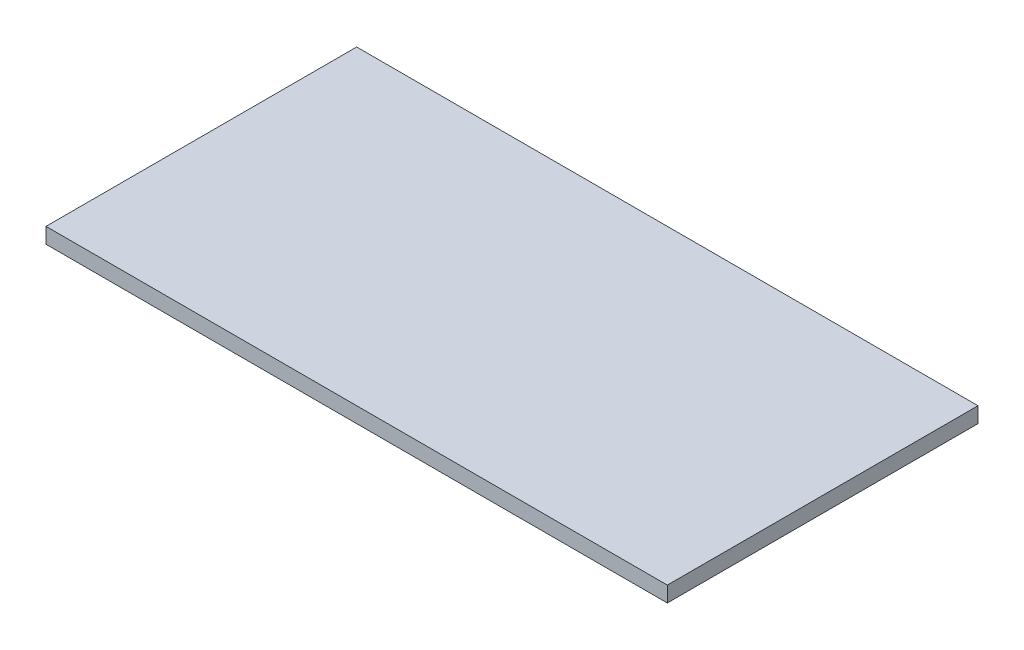
ISO-10303-21;
HEADER;
FILE_DESCRIPTION(('STEP AP214'),'2;1');
FILE_NAME('part.step','',(''),(''),'','','');
FILE_SCHEMA(('AUTOMOTIVE_DESIGN { 1 0 10303 214 1 1 1 1 }'));
ENDSEC;
DATA;
#1=APPLICATION_CONTEXT('core data for automotive mechanical design processes');
#2=APPLICATION_PROTOCOL_DEFINITION('international standard','automotive_design',2000,#1);
#3=PRODUCT_CONTEXT('',#1,'mechanical');
#4=PRODUCT('Part','Part','',(#3));
#5=PRODUCT_RELATED_PRODUCT_CATEGORY('part','',(#4));
#6=PRODUCT_DEFINITION_FORMATION('','',#4);
#7=PRODUCT_DEFINITION_CONTEXT('part definition',#1,'design');
#8=PRODUCT_DEFINITION('design','',#6,#7);
#9=PRODUCT_DEFINITION_SHAPE('','',#8);
#10=(LENGTH_UNIT() NAMED_UNIT(*) SI_UNIT(.MILLI.,.METRE.));
#11=(NAMED_UNIT(*) PLANE_ANGLE_UNIT() SI_UNIT($,.RADIAN.));
#12=(NAMED_UNIT(*) SI_UNIT($,.STERADIAN.) SOLID_ANGLE_UNIT());
#13=UNCERTAINTY_MEASURE_WITH_UNIT(LENGTH_MEASURE(1.E-05),#10,'distance_accuracy_value','');
#14=(GEOMETRIC_REPRESENTATION_CONTEXT(3) GLOBAL_UNCERTAINTY_ASSIGNED_CONTEXT((#13)) GLOBAL_UNIT_ASSIGNED_CONTEXT((#10,
#11,#12)) REPRESENTATION_CONTEXT('',''));
#15=CARTESIAN_POINT('',(0.,0.,0.));
#16=DIRECTION('',(0.,0.,1.));
#17=DIRECTION('',(1.,0.,0.));
#18=AXIS2_PLACEMENT_3D('',#15,#16,#17);
#19=CARTESIAN_POINT('',(0.,5.08,0.));
#20=DIRECTION('',(1.,0.,0.));
#21=DIRECTION('',(0.,0.,-1.));
#22=AXIS2_PLACEMENT_3D('',#19,#20,#21);
#23=PLANE('',#22);
#24=DIRECTION('',(0.,0.,1.));
#25=VECTOR('',#24,1.);
#26=CARTESIAN_POINT('',(0.,0.,0.));
#27=LINE('',#26,#25);
#28=CARTESIAN_POINT('',(0.,0.,-101.6));
#29=VERTEX_POINT('',#28);
#30=CARTESIAN_POINT('',(0.,0.,0.));
#31=VERTEX_POINT('',#30);
#32=EDGE_CURVE('E95',#29,#31,#27,.T.);
#33=ORIENTED_EDGE('',*,*,#32,.T.);
#34=DIRECTION('',(0.,-1.,0.));
#35=VECTOR('',#34,1.);
#36=CARTESIAN_POINT('',(0.,5.08,0.));
#37=LINE('',#36,#35);
#38=CARTESIAN_POINT('',(0.,5.08,0.));
#39=VERTEX_POINT('',#38);
#40=EDGE_CURVE('E11',#39,#31,#37,.T.);
#41=ORIENTED_EDGE('',*,*,#40,.F.);
#42=DIRECTION('',(0.,0.,1.));
#43=VECTOR('',#42,1.);
#44=CARTESIAN_POINT('',(0.,5.08,0.));
#45=LINE('',#44,#43);
#46=CARTESIAN_POINT('',(0.,5.08,-101.6));
#47=VERTEX_POINT('',#46);
#48=EDGE_CURVE('E83',#47,#39,#45,.T.);
#49=ORIENTED_EDGE('',*,*,#48,.F.);
#50=DIRECTION('',(0.,-1.,0.));
#51=VECTOR('',#50,1.);
#52=CARTESIAN_POINT('',(0.,5.08,-101.6));
#53=LINE('',#52,#51);
#54=EDGE_CURVE('E91',#47,#29,#53,.T.);
#55=ORIENTED_EDGE('',*,*,#54,.T.);
#56=EDGE_LOOP('',(#33,#41,#49,#55));
#57=FACE_BOUND('',#56,.T.);
#58=ADVANCED_FACE('F32',(#57),#23,.F.);
#59=CARTESIAN_POINT('',(0.,5.08,0.));
#60=DIRECTION('',(0.,0.,-1.));
#61=DIRECTION('',(-1.,0.,0.));
#62=AXIS2_PLACEMENT_3D('',#59,#60,#61);
#63=PLANE('',#62);
#64=DIRECTION('',(1.,0.,0.));
#65=VECTOR('',#64,1.);
#66=CARTESIAN_POINT('',(0.,0.,0.));
#67=LINE('',#66,#65);
#68=CARTESIAN_POINT('',(203.2,0.,0.));
#69=VERTEX_POINT('',#68);
#70=EDGE_CURVE('E87',#31,#69,#67,.T.);
#71=ORIENTED_EDGE('',*,*,#70,.T.);
#72=DIRECTION('',(0.,-1.,0.));
#73=VECTOR('',#72,1.);
#74=CARTESIAN_POINT('',(203.2,5.08,0.));
#75=LINE('',#74,#73);
#76=CARTESIAN_POINT('',(203.2,5.08,0.));
#77=VERTEX_POINT('',#76);
#78=EDGE_CURVE('E40',#77,#69,#75,.T.);
#79=ORIENTED_EDGE('',*,*,#78,.F.);
#80=DIRECTION('',(1.,0.,0.));
#81=VECTOR('',#80,1.);
#82=CARTESIAN_POINT('',(0.,5.08,0.));
#83=LINE('',#82,#81);
#84=EDGE_CURVE('E78',#39,#77,#83,.T.);
#85=ORIENTED_EDGE('',*,*,#84,.F.);
#86=ORIENTED_EDGE('',*,*,#40,.T.);
#87=EDGE_LOOP('',(#71,#79,#85,#86));
#88=FACE_BOUND('',#87,.T.);
#89=ADVANCED_FACE('F86',(#88),#63,.F.);
#90=CARTESIAN_POINT('',(203.2,5.08,0.));
#91=DIRECTION('',(-1.,0.,0.));
#92=DIRECTION('',(0.,0.,1.));
#93=AXIS2_PLACEMENT_3D('',#90,#91,#92);
#94=PLANE('',#93);
#95=DIRECTION('',(0.,0.,-1.));
#96=VECTOR('',#95,1.);
#97=CARTESIAN_POINT('',(203.2,0.,0.));
#98=LINE('',#97,#96);
#99=CARTESIAN_POINT('',(203.2,0.,-101.6));
#100=VERTEX_POINT('',#99);
#101=EDGE_CURVE('E65',#69,#100,#98,.T.);
#102=ORIENTED_EDGE('',*,*,#101,.T.);
#103=DIRECTION('',(0.,-1.,0.));
#104=VECTOR('',#103,1.);
#105=CARTESIAN_POINT('',(203.2,5.08,-101.6));
#106=LINE('',#105,#104);
#107=CARTESIAN_POINT('',(203.2,5.08,-101.6));
#108=VERTEX_POINT('',#107);
#109=EDGE_CURVE('E88',#108,#100,#106,.T.);
#110=ORIENTED_EDGE('',*,*,#109,.F.);
#111=DIRECTION('',(0.,0.,-1.));
#112=VECTOR('',#111,1.);
#113=CARTESIAN_POINT('',(203.2,5.08,0.));
#114=LINE('',#113,#112);
#115=EDGE_CURVE('E81',#77,#108,#114,.T.);
#116=ORIENTED_EDGE('',*,*,#115,.F.);
#117=ORIENTED_EDGE('',*,*,#78,.T.);
#118=EDGE_LOOP('',(#102,#110,#116,#117));
#119=FACE_BOUND('',#118,.T.);
#120=ADVANCED_FACE('F89',(#119),#94,.F.);
#121=CARTESIAN_POINT('',(0.,5.08,-101.6));
#122=DIRECTION('',(0.,0.,1.));
#123=DIRECTION('',(1.,0.,0.));
#124=AXIS2_PLACEMENT_3D('',#121,#122,#123);
#125=PLANE('',#124);
#126=DIRECTION('',(-1.,0.,0.));
#127=VECTOR('',#126,1.);
#128=CARTESIAN_POINT('',(0.,0.,-101.6));
#129=LINE('',#128,#127);
#130=EDGE_CURVE('E71',#100,#29,#129,.T.);
#131=ORIENTED_EDGE('',*,*,#130,.T.);
#132=ORIENTED_EDGE('',*,*,#54,.F.);
#133=DIRECTION('',(-1.,0.,0.));
#134=VECTOR('',#133,1.);
#135=CARTESIAN_POINT('',(0.,5.08,-101.6));
#136=LINE('',#135,#134);
#137=EDGE_CURVE('E48',#108,#47,#136,.T.);
#138=ORIENTED_EDGE('',*,*,#137,.F.);
#139=ORIENTED_EDGE('',*,*,#109,.T.);
#140=EDGE_LOOP('',(#131,#132,#138,#139));
#141=FACE_BOUND('',#140,.T.);
#142=ADVANCED_FACE('F102',(#141),#125,.F.);
#143=CARTESIAN_POINT('',(0.,5.08,0.));
#144=DIRECTION('',(0.,-1.,0.));
#145=DIRECTION('',(0.,0.,-1.));
#146=AXIS2_PLACEMENT_3D('',#143,#144,#145);
#147=PLANE('',#146);
#148=ORIENTED_EDGE('',*,*,#48,.T.);
#149=ORIENTED_EDGE('',*,*,#84,.T.);
#150=ORIENTED_EDGE('',*,*,#115,.T.);
#151=ORIENTED_EDGE('',*,*,#137,.T.);
#152=EDGE_LOOP('',(#148,#149,#150,#151));
#153=FACE_BOUND('',#152,.T.);
#154=ADVANCED_FACE('F79',(#153),#147,.F.);
#155=CARTESIAN_POINT('',(0.,0.,0.));
#156=DIRECTION('',(0.,-1.,0.));
#157=DIRECTION('',(0.,0.,-1.));
#158=AXIS2_PLACEMENT_3D('',#155,#156,#157);
#159=PLANE('',#158);
#160=ORIENTED_EDGE('',*,*,#32,.F.);
#161=ORIENTED_EDGE('',*,*,#130,.F.);
#162=ORIENTED_EDGE('',*,*,#101,.F.);
#163=ORIENTED_EDGE('',*,*,#70,.F.);
#164=EDGE_LOOP('',(#160,#161,#162,#163));
#165=FACE_BOUND('',#164,.T.);
#166=ADVANCED_FACE('F105',(#165),#159,.T.);
#167=CLOSED_SHELL('',(#58,#89,#120,#142,#154,#166));
#168=MANIFOLD_SOLID_BREP('B2',#167);
#169=ADVANCED_BREP_SHAPE_REPRESENTATION('',(#18,#168),#14);
#170=SHAPE_DEFINITION_REPRESENTATION(#9,#169);
ENDSEC;
END-ISO-10303-21;
